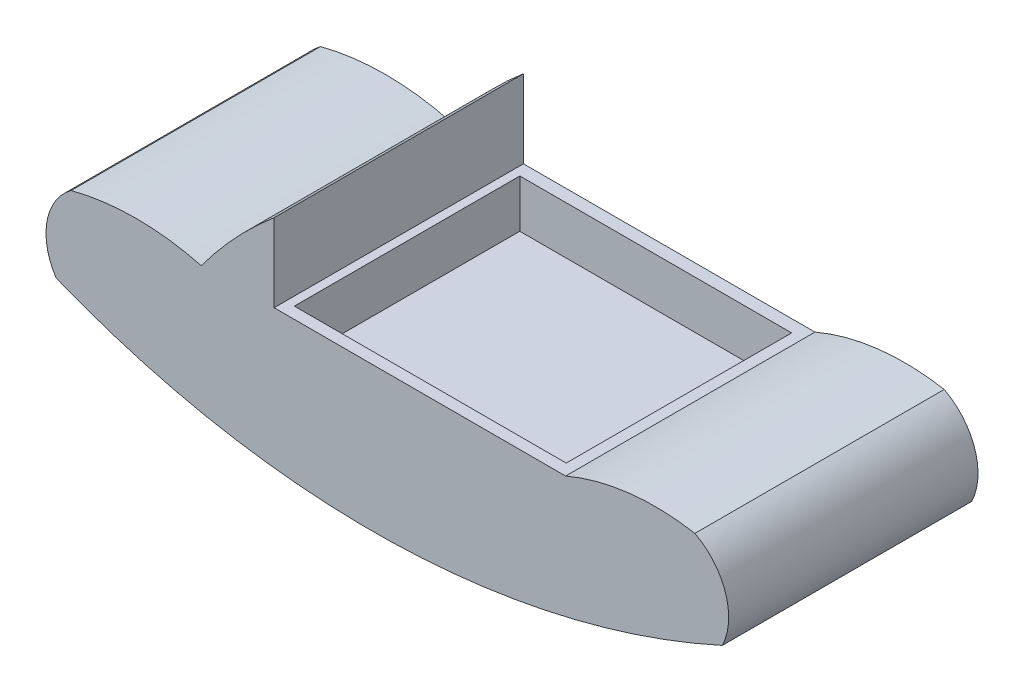
ISO-10303-21;
HEADER;
FILE_DESCRIPTION(('STEP AP214'),'2;1');
FILE_NAME('part.step','',(''),(''),'','','');
FILE_SCHEMA(('AUTOMOTIVE_DESIGN { 1 0 10303 214 1 1 1 1 }'));
ENDSEC;
DATA;
#1=APPLICATION_CONTEXT('core data for automotive mechanical design processes');
#2=APPLICATION_PROTOCOL_DEFINITION('international standard','automotive_design',2000,#1);
#3=PRODUCT_CONTEXT('',#1,'mechanical');
#4=PRODUCT('Part','Part','',(#3));
#5=PRODUCT_RELATED_PRODUCT_CATEGORY('part','',(#4));
#6=PRODUCT_DEFINITION_FORMATION('','',#4);
#7=PRODUCT_DEFINITION_CONTEXT('part definition',#1,'design');
#8=PRODUCT_DEFINITION('design','',#6,#7);
#9=PRODUCT_DEFINITION_SHAPE('','',#8);
#10=(LENGTH_UNIT() NAMED_UNIT(*) SI_UNIT(.MILLI.,.METRE.));
#11=(NAMED_UNIT(*) PLANE_ANGLE_UNIT() SI_UNIT($,.RADIAN.));
#12=(NAMED_UNIT(*) SI_UNIT($,.STERADIAN.) SOLID_ANGLE_UNIT());
#13=UNCERTAINTY_MEASURE_WITH_UNIT(LENGTH_MEASURE(1.E-05),#10,'distance_accuracy_value','');
#14=(GEOMETRIC_REPRESENTATION_CONTEXT(3) GLOBAL_UNCERTAINTY_ASSIGNED_CONTEXT((#13)) GLOBAL_UNIT_ASSIGNED_CONTEXT((#10,
#11,#12)) REPRESENTATION_CONTEXT('',''));
#15=CARTESIAN_POINT('',(0.,0.,0.));
#16=DIRECTION('',(0.,0.,1.));
#17=DIRECTION('',(1.,0.,0.));
#18=AXIS2_PLACEMENT_3D('',#15,#16,#17);
#19=CARTESIAN_POINT('',(0.,0.,121.666));
#20=DIRECTION('',(0.,1.,0.));
#21=DIRECTION('',(0.,0.,1.));
#22=AXIS2_PLACEMENT_3D('',#19,#20,#21);
#23=PLANE('',#22);
#24=DIRECTION('',(1.,0.,0.));
#25=VECTOR('',#24,1.);
#26=CARTESIAN_POINT('',(0.,0.,0.));
#27=LINE('',#26,#25);
#28=CARTESIAN_POINT('',(-53.34,0.,0.));
#29=VERTEX_POINT('',#28);
#30=CARTESIAN_POINT('',(88.9,0.,0.));
#31=VERTEX_POINT('',#30);
#32=EDGE_CURVE('E159',#29,#31,#27,.T.);
#33=ORIENTED_EDGE('',*,*,#32,.F.);
#34=DIRECTION('',(0.,0.,-1.));
#35=VECTOR('',#34,1.);
#36=CARTESIAN_POINT('',(-53.34,0.,121.666));
#37=LINE('',#36,#35);
#38=CARTESIAN_POINT('',(-53.34,0.,121.666));
#39=VERTEX_POINT('',#38);
#40=EDGE_CURVE('E130',#39,#29,#37,.T.);
#41=ORIENTED_EDGE('',*,*,#40,.F.);
#42=DIRECTION('',(1.,0.,0.));
#43=VECTOR('',#42,1.);
#44=CARTESIAN_POINT('',(0.,0.,121.666));
#45=LINE('',#44,#43);
#46=CARTESIAN_POINT('',(88.9,0.,121.666));
#47=VERTEX_POINT('',#46);
#48=EDGE_CURVE('E138',#39,#47,#45,.T.);
#49=ORIENTED_EDGE('',*,*,#48,.T.);
#50=DIRECTION('',(0.,0.,-1.));
#51=VECTOR('',#50,1.);
#52=CARTESIAN_POINT('',(88.9,0.,121.666));
#53=LINE('',#52,#51);
#54=EDGE_CURVE('E170',#47,#31,#53,.T.);
#55=ORIENTED_EDGE('',*,*,#54,.T.);
#56=EDGE_LOOP('',(#33,#41,#49,#55));
#57=FACE_BOUND('',#56,.T.);
#58=DIRECTION('',(-1.,0.,0.));
#59=VECTOR('',#58,1.);
#60=CARTESIAN_POINT('',(0.,0.,116.047251747545));
#61=LINE('',#60,#59);
#62=CARTESIAN_POINT('',(83.5621424278667,0.,116.047251747545));
#63=VERTEX_POINT('',#62);
#64=CARTESIAN_POINT('',(-49.0912804056653,0.,116.047251747545));
#65=VERTEX_POINT('',#64);
#66=EDGE_CURVE('E45',#63,#65,#61,.T.);
#67=ORIENTED_EDGE('',*,*,#66,.T.);
#68=DIRECTION('',(0.,0.,-1.));
#69=VECTOR('',#68,1.);
#70=CARTESIAN_POINT('',(-49.0912804056653,0.,121.666));
#71=LINE('',#70,#69);
#72=CARTESIAN_POINT('',(-49.0912804056654,0.,6.04256253639868));
#73=VERTEX_POINT('',#72);
#74=EDGE_CURVE('E11',#65,#73,#71,.T.);
#75=ORIENTED_EDGE('',*,*,#74,.T.);
#76=DIRECTION('',(1.,0.,0.));
#77=VECTOR('',#76,1.);
#78=CARTESIAN_POINT('',(0.,0.,6.04256253639868));
#79=LINE('',#78,#77);
#80=CARTESIAN_POINT('',(83.5621424278667,0.,6.04256253639868));
#81=VERTEX_POINT('',#80);
#82=EDGE_CURVE('E178',#73,#81,#79,.T.);
#83=ORIENTED_EDGE('',*,*,#82,.T.);
#84=DIRECTION('',(0.,0.,1.));
#85=VECTOR('',#84,1.);
#86=CARTESIAN_POINT('',(83.5621424278667,0.,121.666));
#87=LINE('',#86,#85);
#88=EDGE_CURVE('E181',#81,#63,#87,.T.);
#89=ORIENTED_EDGE('',*,*,#88,.T.);
#90=EDGE_LOOP('',(#67,#75,#83,#89));
#91=FACE_BOUND('',#90,.T.);
#92=ADVANCED_FACE('F37',(#57,#91),#23,.T.);
#93=CARTESIAN_POINT('',(-134.71417920201,-24.1750191561585,121.666));
#94=DIRECTION('',(0.,0.,-1.));
#95=DIRECTION('',(-1.,0.,0.));
#96=AXIS2_PLACEMENT_3D('',#93,#94,#95);
#97=CYLINDRICAL_SURFACE('',#96,29.9536276350501);
#98=CARTESIAN_POINT('',(-134.71417920201,-24.1750191561585,0.));
#99=DIRECTION('',(0.,0.,1.));
#100=DIRECTION('',(1.,0.,0.));
#101=AXIS2_PLACEMENT_3D('',#98,#99,#100);
#102=CIRCLE('',#101,29.9536276350501);
#103=CARTESIAN_POINT('',(-152.4,0.,0.));
#104=VERTEX_POINT('',#103);
#105=CARTESIAN_POINT('',(-159.736653386454,-40.64,0.));
#106=VERTEX_POINT('',#105);
#107=EDGE_CURVE('E146',#104,#106,#102,.T.);
#108=ORIENTED_EDGE('',*,*,#107,.T.);
#109=DIRECTION('',(0.,0.,-1.));
#110=VECTOR('',#109,1.);
#111=CARTESIAN_POINT('',(-159.736653386454,-40.64,121.666));
#112=LINE('',#111,#110);
#113=CARTESIAN_POINT('',(-159.736653386454,-40.64,121.666));
#114=VERTEX_POINT('',#113);
#115=EDGE_CURVE('E176',#114,#106,#112,.T.);
#116=ORIENTED_EDGE('',*,*,#115,.F.);
#117=CARTESIAN_POINT('',(-134.71417920201,-24.1750191561585,121.666));
#118=DIRECTION('',(0.,0.,1.));
#119=DIRECTION('',(1.,0.,0.));
#120=AXIS2_PLACEMENT_3D('',#117,#118,#119);
#121=CIRCLE('',#120,29.9536276350501);
#122=CARTESIAN_POINT('',(-152.4,0.,121.666));
#123=VERTEX_POINT('',#122);
#124=EDGE_CURVE('E166',#123,#114,#121,.T.);
#125=ORIENTED_EDGE('',*,*,#124,.F.);
#126=DIRECTION('',(0.,0.,-1.));
#127=VECTOR('',#126,1.);
#128=CARTESIAN_POINT('',(-152.4,0.,121.666));
#129=LINE('',#128,#127);
#130=EDGE_CURVE('E142',#123,#104,#129,.T.);
#131=ORIENTED_EDGE('',*,*,#130,.T.);
#132=EDGE_LOOP('',(#108,#116,#125,#131));
#133=FACE_BOUND('',#132,.T.);
#134=ADVANCED_FACE('F39',(#133),#97,.T.);
#135=CARTESIAN_POINT('',(-5.69197600210424,342.193271716442,121.666));
#136=DIRECTION('',(0.,0.,-1.));
#137=DIRECTION('',(-1.,0.,0.));
#138=AXIS2_PLACEMENT_3D('',#135,#136,#137);
#139=CYLINDRICAL_SURFACE('',#138,412.663393777015);
#140=CARTESIAN_POINT('',(-5.69197600210424,342.193271716442,0.));
#141=DIRECTION('',(0.,0.,1.));
#142=DIRECTION('',(1.,0.,0.));
#143=AXIS2_PLACEMENT_3D('',#140,#141,#142);
#144=CIRCLE('',#143,412.663393777015);
#145=CARTESIAN_POINT('',(165.383346613546,-33.3387649402391,0.));
#146=VERTEX_POINT('',#145);
#147=EDGE_CURVE('E149',#106,#146,#144,.T.);
#148=ORIENTED_EDGE('',*,*,#147,.T.);
#149=DIRECTION('',(0.,0.,-1.));
#150=VECTOR('',#149,1.);
#151=CARTESIAN_POINT('',(165.383346613546,-33.3387649402391,121.666));
#152=LINE('',#151,#150);
#153=CARTESIAN_POINT('',(165.383346613546,-33.3387649402391,121.666));
#154=VERTEX_POINT('',#153);
#155=EDGE_CURVE('E174',#154,#146,#152,.T.);
#156=ORIENTED_EDGE('',*,*,#155,.F.);
#157=CARTESIAN_POINT('',(-5.69197600210424,342.193271716442,121.666));
#158=DIRECTION('',(0.,0.,1.));
#159=DIRECTION('',(1.,0.,0.));
#160=AXIS2_PLACEMENT_3D('',#157,#158,#159);
#161=CIRCLE('',#160,412.663393777015);
#162=EDGE_CURVE('E103',#114,#154,#161,.T.);
#163=ORIENTED_EDGE('',*,*,#162,.F.);
#164=ORIENTED_EDGE('',*,*,#115,.T.);
#165=EDGE_LOOP('',(#148,#156,#163,#164));
#166=FACE_BOUND('',#165,.T.);
#167=ADVANCED_FACE('F241',(#166),#139,.T.);
#168=CARTESIAN_POINT('',(137.74316544738,-19.9248273625668,121.666));
#169=DIRECTION('',(0.,0.,-1.));
#170=DIRECTION('',(-1.,0.,0.));
#171=AXIS2_PLACEMENT_3D('',#168,#169,#170);
#172=CYLINDRICAL_SURFACE('',#171,30.7231726264742);
#173=CARTESIAN_POINT('',(137.74316544738,-19.9248273625668,0.));
#174=DIRECTION('',(0.,0.,1.));
#175=DIRECTION('',(1.,0.,0.));
#176=AXIS2_PLACEMENT_3D('',#173,#174,#175);
#177=CIRCLE('',#176,30.7231726264742);
#178=CARTESIAN_POINT('',(151.978855146571,7.30123505976094,0.));
#179=VERTEX_POINT('',#178);
#180=EDGE_CURVE('E153',#179,#146,#177,.F.);
#181=ORIENTED_EDGE('',*,*,#180,.F.);
#182=DIRECTION('',(0.,0.,-1.));
#183=VECTOR('',#182,1.);
#184=CARTESIAN_POINT('',(151.978855146571,7.30123505976094,121.666));
#185=LINE('',#184,#183);
#186=CARTESIAN_POINT('',(151.978855146571,7.30123505976094,121.666));
#187=VERTEX_POINT('',#186);
#188=EDGE_CURVE('E172',#187,#179,#185,.T.);
#189=ORIENTED_EDGE('',*,*,#188,.F.);
#190=CARTESIAN_POINT('',(137.74316544738,-19.9248273625668,121.666));
#191=DIRECTION('',(0.,0.,1.));
#192=DIRECTION('',(1.,0.,0.));
#193=AXIS2_PLACEMENT_3D('',#190,#191,#192);
#194=CIRCLE('',#193,30.7231726264742);
#195=EDGE_CURVE('E212',#187,#154,#194,.F.);
#196=ORIENTED_EDGE('',*,*,#195,.T.);
#197=ORIENTED_EDGE('',*,*,#155,.T.);
#198=EDGE_LOOP('',(#181,#189,#196,#197));
#199=FACE_BOUND('',#198,.T.);
#200=ADVANCED_FACE('F247',(#199),#172,.T.);
#201=CARTESIAN_POINT('',(132.637894634103,-101.737762715576,121.666));
#202=DIRECTION('',(0.,0.,-1.));
#203=DIRECTION('',(-1.,0.,0.));
#204=AXIS2_PLACEMENT_3D('',#201,#202,#203);
#205=CYLINDRICAL_SURFACE('',#204,110.741030288664);
#206=CARTESIAN_POINT('',(132.637894634103,-101.737762715576,0.));
#207=DIRECTION('',(0.,0.,1.));
#208=DIRECTION('',(1.,0.,0.));
#209=AXIS2_PLACEMENT_3D('',#206,#207,#208);
#210=CIRCLE('',#209,110.741030288664);
#211=EDGE_CURVE('E156',#31,#179,#210,.F.);
#212=ORIENTED_EDGE('',*,*,#211,.F.);
#213=ORIENTED_EDGE('',*,*,#54,.F.);
#214=CARTESIAN_POINT('',(132.637894634103,-101.737762715576,121.666));
#215=DIRECTION('',(0.,0.,1.));
#216=DIRECTION('',(1.,0.,0.));
#217=AXIS2_PLACEMENT_3D('',#214,#215,#216);
#218=CIRCLE('',#217,110.741030288664);
#219=EDGE_CURVE('E215',#47,#187,#218,.F.);
#220=ORIENTED_EDGE('',*,*,#219,.T.);
#221=ORIENTED_EDGE('',*,*,#188,.T.);
#222=EDGE_LOOP('',(#212,#213,#220,#221));
#223=FACE_BOUND('',#222,.T.);
#224=ADVANCED_FACE('F244',(#223),#205,.T.);
#225=CARTESIAN_POINT('',(-53.34,0.,121.666));
#226=DIRECTION('',(1.,0.,0.));
#227=DIRECTION('',(0.,1.,0.));
#228=AXIS2_PLACEMENT_3D('',#225,#226,#227);
#229=PLANE('',#228);
#230=DIRECTION('',(0.,-1.,0.));
#231=VECTOR('',#230,1.);
#232=CARTESIAN_POINT('',(-53.34,0.,0.));
#233=LINE('',#232,#231);
#234=CARTESIAN_POINT('',(-53.34,38.0747011952191,0.));
#235=VERTEX_POINT('',#234);
#236=EDGE_CURVE('E125',#235,#29,#233,.T.);
#237=ORIENTED_EDGE('',*,*,#236,.F.);
#238=DIRECTION('',(0.,0.,-1.));
#239=VECTOR('',#238,1.);
#240=CARTESIAN_POINT('',(-53.34,38.0747011952191,121.666));
#241=LINE('',#240,#239);
#242=CARTESIAN_POINT('',(-53.34,38.0747011952191,121.666));
#243=VERTEX_POINT('',#242);
#244=EDGE_CURVE('E120',#243,#235,#241,.T.);
#245=ORIENTED_EDGE('',*,*,#244,.F.);
#246=DIRECTION('',(0.,-1.,0.));
#247=VECTOR('',#246,1.);
#248=CARTESIAN_POINT('',(-53.34,0.,121.666));
#249=LINE('',#248,#247);
#250=EDGE_CURVE('E123',#243,#39,#249,.T.);
#251=ORIENTED_EDGE('',*,*,#250,.T.);
#252=ORIENTED_EDGE('',*,*,#40,.T.);
#253=EDGE_LOOP('',(#237,#245,#251,#252));
#254=FACE_BOUND('',#253,.T.);
#255=ADVANCED_FACE('F122',(#254),#229,.T.);
#256=CARTESIAN_POINT('',(90.5627680397103,-131.966834622734,121.666));
#257=DIRECTION('',(0.,0.,-1.));
#258=DIRECTION('',(-1.,0.,0.));
#259=AXIS2_PLACEMENT_3D('',#256,#257,#258);
#260=CYLINDRICAL_SURFACE('',#259,222.760253530155);
#261=CARTESIAN_POINT('',(90.5627680397103,-131.966834622734,0.));
#262=DIRECTION('',(0.,0.,1.));
#263=DIRECTION('',(1.,0.,0.));
#264=AXIS2_PLACEMENT_3D('',#261,#262,#263);
#265=CIRCLE('',#264,222.760253530155);
#266=CARTESIAN_POINT('',(-88.9,0.,0.));
#267=VERTEX_POINT('',#266);
#268=EDGE_CURVE('E163',#267,#235,#265,.F.);
#269=ORIENTED_EDGE('',*,*,#268,.F.);
#270=DIRECTION('',(0.,0.,-1.));
#271=VECTOR('',#270,1.);
#272=CARTESIAN_POINT('',(-88.9,0.,121.666));
#273=LINE('',#272,#271);
#274=CARTESIAN_POINT('',(-88.9,0.,121.666));
#275=VERTEX_POINT('',#274);
#276=EDGE_CURVE('E131',#275,#267,#273,.T.);
#277=ORIENTED_EDGE('',*,*,#276,.F.);
#278=CARTESIAN_POINT('',(90.5627680397103,-131.966834622734,121.666));
#279=DIRECTION('',(0.,0.,1.));
#280=DIRECTION('',(1.,0.,0.));
#281=AXIS2_PLACEMENT_3D('',#278,#279,#280);
#282=CIRCLE('',#281,222.760253530155);
#283=EDGE_CURVE('E135',#275,#243,#282,.F.);
#284=ORIENTED_EDGE('',*,*,#283,.T.);
#285=ORIENTED_EDGE('',*,*,#244,.T.);
#286=EDGE_LOOP('',(#269,#277,#284,#285));
#287=FACE_BOUND('',#286,.T.);
#288=ADVANCED_FACE('F140',(#287),#260,.T.);
#289=CARTESIAN_POINT('',(-120.65,-121.040944063984,121.666));
#290=DIRECTION('',(0.,0.,-1.));
#291=DIRECTION('',(-1.,0.,0.));
#292=AXIS2_PLACEMENT_3D('',#289,#290,#291);
#293=CYLINDRICAL_SURFACE('',#292,125.135816774817);
#294=CARTESIAN_POINT('',(-120.65,-121.040944063984,0.));
#295=DIRECTION('',(0.,0.,1.));
#296=DIRECTION('',(1.,0.,0.));
#297=AXIS2_PLACEMENT_3D('',#294,#295,#296);
#298=CIRCLE('',#297,125.135816774817);
#299=EDGE_CURVE('E94',#267,#104,#298,.T.);
#300=ORIENTED_EDGE('',*,*,#299,.T.);
#301=ORIENTED_EDGE('',*,*,#130,.F.);
#302=CARTESIAN_POINT('',(-120.65,-121.040944063984,121.666));
#303=DIRECTION('',(0.,0.,1.));
#304=DIRECTION('',(1.,0.,0.));
#305=AXIS2_PLACEMENT_3D('',#302,#303,#304);
#306=CIRCLE('',#305,125.135816774817);
#307=EDGE_CURVE('E61',#275,#123,#306,.T.);
#308=ORIENTED_EDGE('',*,*,#307,.F.);
#309=ORIENTED_EDGE('',*,*,#276,.T.);
#310=EDGE_LOOP('',(#300,#301,#308,#309));
#311=FACE_BOUND('',#310,.T.);
#312=ADVANCED_FACE('F226',(#311),#293,.T.);
#313=CARTESIAN_POINT('',(0.,0.,121.666));
#314=DIRECTION('',(0.,0.,1.));
#315=DIRECTION('',(1.,0.,0.));
#316=AXIS2_PLACEMENT_3D('',#313,#314,#315);
#317=PLANE('',#316);
#318=ORIENTED_EDGE('',*,*,#124,.T.);
#319=ORIENTED_EDGE('',*,*,#162,.T.);
#320=ORIENTED_EDGE('',*,*,#195,.F.);
#321=ORIENTED_EDGE('',*,*,#219,.F.);
#322=ORIENTED_EDGE('',*,*,#48,.F.);
#323=ORIENTED_EDGE('',*,*,#250,.F.);
#324=ORIENTED_EDGE('',*,*,#283,.F.);
#325=ORIENTED_EDGE('',*,*,#307,.T.);
#326=EDGE_LOOP('',(#318,#319,#320,#321,#322,#323,#324,#325));
#327=FACE_BOUND('',#326,.T.);
#328=ADVANCED_FACE('F134',(#327),#317,.T.);
#329=CARTESIAN_POINT('',(0.,0.,0.));
#330=DIRECTION('',(0.,0.,1.));
#331=DIRECTION('',(1.,0.,0.));
#332=AXIS2_PLACEMENT_3D('',#329,#330,#331);
#333=PLANE('',#332);
#334=ORIENTED_EDGE('',*,*,#107,.F.);
#335=ORIENTED_EDGE('',*,*,#299,.F.);
#336=ORIENTED_EDGE('',*,*,#268,.T.);
#337=ORIENTED_EDGE('',*,*,#236,.T.);
#338=ORIENTED_EDGE('',*,*,#32,.T.);
#339=ORIENTED_EDGE('',*,*,#211,.T.);
#340=ORIENTED_EDGE('',*,*,#180,.T.);
#341=ORIENTED_EDGE('',*,*,#147,.F.);
#342=EDGE_LOOP('',(#334,#335,#336,#337,#338,#339,#340,#341));
#343=FACE_BOUND('',#342,.T.);
#344=ADVANCED_FACE('F222',(#343),#333,.F.);
#345=CARTESIAN_POINT('',(-49.0912804056654,34.29,6.04256253639868));
#346=DIRECTION('',(1.,0.,0.));
#347=DIRECTION('',(0.,0.,-1.));
#348=AXIS2_PLACEMENT_3D('',#345,#346,#347);
#349=PLANE('',#348);
#350=DIRECTION('',(0.,-1.,0.));
#351=VECTOR('',#350,1.);
#352=CARTESIAN_POINT('',(-49.0912804056653,34.29,116.047251747545));
#353=LINE('',#352,#351);
#354=CARTESIAN_POINT('',(-49.0912804056653,-23.3680000000001,116.047251747545));
#355=VERTEX_POINT('',#354);
#356=EDGE_CURVE('E150',#65,#355,#353,.T.);
#357=ORIENTED_EDGE('',*,*,#356,.T.);
#358=DIRECTION('',(0.,0.,1.));
#359=VECTOR('',#358,1.);
#360=CARTESIAN_POINT('',(-49.0912804056654,-23.3680000000001,6.04256253639868));
#361=LINE('',#360,#359);
#362=CARTESIAN_POINT('',(-49.0912804056654,-23.3680000000001,6.04256253639868));
#363=VERTEX_POINT('',#362);
#364=EDGE_CURVE('E352',#363,#355,#361,.T.);
#365=ORIENTED_EDGE('',*,*,#364,.F.);
#366=DIRECTION('',(0.,-1.,0.));
#367=VECTOR('',#366,1.);
#368=CARTESIAN_POINT('',(-49.0912804056654,34.29,6.04256253639868));
#369=LINE('',#368,#367);
#370=EDGE_CURVE('E206',#73,#363,#369,.T.);
#371=ORIENTED_EDGE('',*,*,#370,.F.);
#372=ORIENTED_EDGE('',*,*,#74,.F.);
#373=EDGE_LOOP('',(#357,#365,#371,#372));
#374=FACE_BOUND('',#373,.T.);
#375=ADVANCED_FACE('F295',(#374),#349,.T.);
#376=CARTESIAN_POINT('',(-49.0912804056653,34.29,116.047251747545));
#377=DIRECTION('',(0.,0.,-1.));
#378=DIRECTION('',(-1.,0.,0.));
#379=AXIS2_PLACEMENT_3D('',#376,#377,#378);
#380=PLANE('',#379);
#381=DIRECTION('',(0.,-1.,0.));
#382=VECTOR('',#381,1.);
#383=CARTESIAN_POINT('',(83.5621424278667,34.29,116.047251747545));
#384=LINE('',#383,#382);
#385=CARTESIAN_POINT('',(83.5621424278667,-23.3680000000001,116.047251747545));
#386=VERTEX_POINT('',#385);
#387=EDGE_CURVE('E196',#63,#386,#384,.T.);
#388=ORIENTED_EDGE('',*,*,#387,.T.);
#389=DIRECTION('',(1.,0.,0.));
#390=VECTOR('',#389,1.);
#391=CARTESIAN_POINT('',(-49.0912804056653,-23.3680000000001,116.047251747545));
#392=LINE('',#391,#390);
#393=EDGE_CURVE('E353',#355,#386,#392,.T.);
#394=ORIENTED_EDGE('',*,*,#393,.F.);
#395=ORIENTED_EDGE('',*,*,#356,.F.);
#396=ORIENTED_EDGE('',*,*,#66,.F.);
#397=EDGE_LOOP('',(#388,#394,#395,#396));
#398=FACE_BOUND('',#397,.T.);
#399=ADVANCED_FACE('F193',(#398),#380,.T.);
#400=CARTESIAN_POINT('',(83.5621424278667,34.29,116.047251747545));
#401=DIRECTION('',(-1.,0.,0.));
#402=DIRECTION('',(0.,0.,1.));
#403=AXIS2_PLACEMENT_3D('',#400,#401,#402);
#404=PLANE('',#403);
#405=DIRECTION('',(0.,-1.,0.));
#406=VECTOR('',#405,1.);
#407=CARTESIAN_POINT('',(83.5621424278667,34.29,6.04256253639868));
#408=LINE('',#407,#406);
#409=CARTESIAN_POINT('',(83.5621424278667,-23.3680000000001,6.04256253639868));
#410=VERTEX_POINT('',#409);
#411=EDGE_CURVE('E52',#81,#410,#408,.T.);
#412=ORIENTED_EDGE('',*,*,#411,.T.);
#413=DIRECTION('',(0.,0.,-1.));
#414=VECTOR('',#413,1.);
#415=CARTESIAN_POINT('',(83.5621424278667,-23.3680000000001,116.047251747545));
#416=LINE('',#415,#414);
#417=EDGE_CURVE('E202',#386,#410,#416,.T.);
#418=ORIENTED_EDGE('',*,*,#417,.F.);
#419=ORIENTED_EDGE('',*,*,#387,.F.);
#420=ORIENTED_EDGE('',*,*,#88,.F.);
#421=EDGE_LOOP('',(#412,#418,#419,#420));
#422=FACE_BOUND('',#421,.T.);
#423=ADVANCED_FACE('F200',(#422),#404,.T.);
#424=CARTESIAN_POINT('',(83.5621424278667,34.29,6.04256253639868));
#425=DIRECTION('',(0.,0.,1.));
#426=DIRECTION('',(1.,0.,0.));
#427=AXIS2_PLACEMENT_3D('',#424,#425,#426);
#428=PLANE('',#427);
#429=ORIENTED_EDGE('',*,*,#370,.T.);
#430=DIRECTION('',(-1.,0.,0.));
#431=VECTOR('',#430,1.);
#432=CARTESIAN_POINT('',(83.5621424278667,-23.3680000000001,6.04256253639868));
#433=LINE('',#432,#431);
#434=EDGE_CURVE('E355',#410,#363,#433,.T.);
#435=ORIENTED_EDGE('',*,*,#434,.F.);
#436=ORIENTED_EDGE('',*,*,#411,.F.);
#437=ORIENTED_EDGE('',*,*,#82,.F.);
#438=EDGE_LOOP('',(#429,#435,#436,#437));
#439=FACE_BOUND('',#438,.T.);
#440=ADVANCED_FACE('F326',(#439),#428,.T.);
#441=CARTESIAN_POINT('',(0.,-23.3680000000001,0.));
#442=DIRECTION('',(0.,1.,0.));
#443=DIRECTION('',(0.,0.,1.));
#444=AXIS2_PLACEMENT_3D('',#441,#442,#443);
#445=PLANE('',#444);
#446=ORIENTED_EDGE('',*,*,#364,.T.);
#447=ORIENTED_EDGE('',*,*,#393,.T.);
#448=ORIENTED_EDGE('',*,*,#417,.T.);
#449=ORIENTED_EDGE('',*,*,#434,.T.);
#450=EDGE_LOOP('',(#446,#447,#448,#449));
#451=FACE_BOUND('',#450,.T.);
#452=ADVANCED_FACE('F335',(#451),#445,.T.);
#453=CLOSED_SHELL('',(#92,#134,#167,#200,#224,#255,#288,#312,#328,#344,#375,#399,#423,#440,#452));
#454=MANIFOLD_SOLID_BREP('B2',#453);
#455=ADVANCED_BREP_SHAPE_REPRESENTATION('',(#18,#454),#14);
#456=SHAPE_DEFINITION_REPRESENTATION(#9,#455);
ENDSEC;
END-ISO-10303-21;
